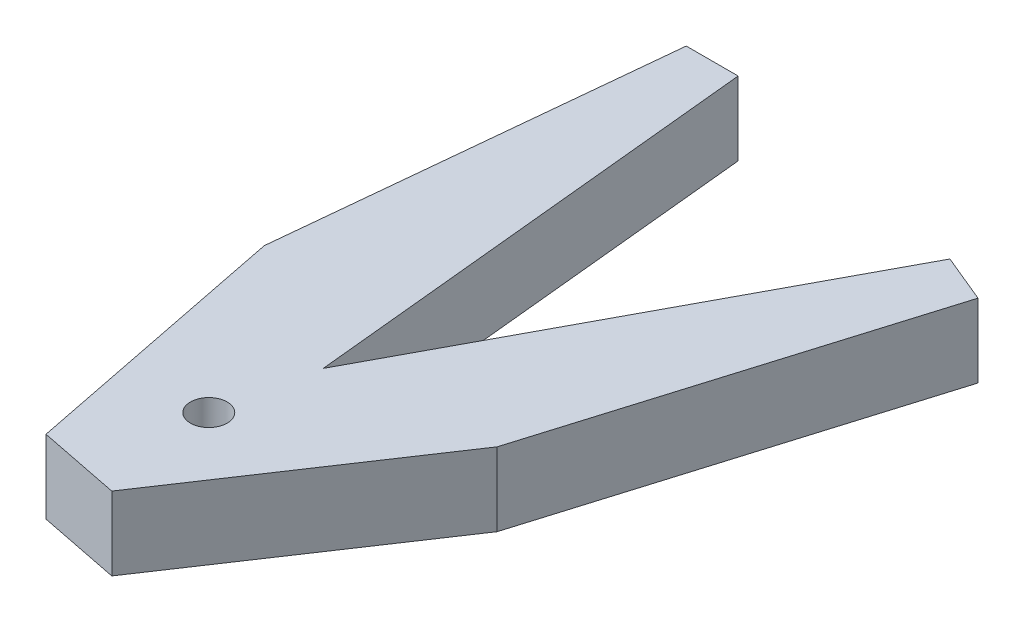
ISO-10303-21;
HEADER;
FILE_DESCRIPTION(('STEP AP214'),'2;1');
FILE_NAME('part.step','',(''),(''),'','','');
FILE_SCHEMA(('AUTOMOTIVE_DESIGN { 1 0 10303 214 1 1 1 1 }'));
ENDSEC;
DATA;
#1=APPLICATION_CONTEXT('core data for automotive mechanical design processes');
#2=APPLICATION_PROTOCOL_DEFINITION('international standard','automotive_design',2000,#1);
#3=PRODUCT_CONTEXT('',#1,'mechanical');
#4=PRODUCT('Part','Part','',(#3));
#5=PRODUCT_RELATED_PRODUCT_CATEGORY('part','',(#4));
#6=PRODUCT_DEFINITION_FORMATION('','',#4);
#7=PRODUCT_DEFINITION_CONTEXT('part definition',#1,'design');
#8=PRODUCT_DEFINITION('design','',#6,#7);
#9=PRODUCT_DEFINITION_SHAPE('','',#8);
#10=(LENGTH_UNIT() NAMED_UNIT(*) SI_UNIT(.MILLI.,.METRE.));
#11=(NAMED_UNIT(*) PLANE_ANGLE_UNIT() SI_UNIT($,.RADIAN.));
#12=(NAMED_UNIT(*) SI_UNIT($,.STERADIAN.) SOLID_ANGLE_UNIT());
#13=UNCERTAINTY_MEASURE_WITH_UNIT(LENGTH_MEASURE(1.E-05),#10,'distance_accuracy_value','');
#14=(GEOMETRIC_REPRESENTATION_CONTEXT(3) GLOBAL_UNCERTAINTY_ASSIGNED_CONTEXT((#13)) GLOBAL_UNIT_ASSIGNED_CONTEXT((#10,
#11,#12)) REPRESENTATION_CONTEXT('',''));
#15=CARTESIAN_POINT('',(0.,0.,0.));
#16=DIRECTION('',(0.,0.,1.));
#17=DIRECTION('',(1.,0.,0.));
#18=AXIS2_PLACEMENT_3D('',#15,#16,#17);
#19=CARTESIAN_POINT('',(5.10008345810155,17.,-1.01446967448503));
#20=DIRECTION('',(-0.980785280403222,0.,0.195090322016169));
#21=DIRECTION('',(0.195090322016169,0.,0.980785280403222));
#22=AXIS2_PLACEMENT_3D('',#19,#20,#21);
#23=PLANE('',#22);
#24=DIRECTION('',(-0.195090322016169,0.,-0.980785280403222));
#25=VECTOR('',#24,1.);
#26=CARTESIAN_POINT('',(5.10008345810155,0.,-1.01446967448503));
#27=LINE('',#26,#25);
#28=CARTESIAN_POINT('',(-2.28332232476133,0.,-38.1333571530355));
#29=VERTEX_POINT('',#28);
#30=CARTESIAN_POINT('',(-14.8168582119146,0.,-101.143697094502));
#31=VERTEX_POINT('',#30);
#32=EDGE_CURVE('E138',#29,#31,#27,.T.);
#33=ORIENTED_EDGE('',*,*,#32,.F.);
#34=DIRECTION('',(0.,-1.,0.));
#35=VECTOR('',#34,1.);
#36=CARTESIAN_POINT('',(-2.28332232476133,17.,-38.1333571530355));
#37=LINE('',#36,#35);
#38=CARTESIAN_POINT('',(-2.28332232476133,17.,-38.1333571530355));
#39=VERTEX_POINT('',#38);
#40=EDGE_CURVE('E11',#39,#29,#37,.T.);
#41=ORIENTED_EDGE('',*,*,#40,.F.);
#42=DIRECTION('',(-0.195090322016169,0.,-0.980785280403222));
#43=VECTOR('',#42,1.);
#44=CARTESIAN_POINT('',(5.10008345810155,17.,-1.01446967448503));
#45=LINE('',#44,#43);
#46=CARTESIAN_POINT('',(-14.8168582119146,17.,-101.143697094502));
#47=VERTEX_POINT('',#46);
#48=EDGE_CURVE('E194',#39,#47,#45,.T.);
#49=ORIENTED_EDGE('',*,*,#48,.T.);
#50=DIRECTION('',(0.,-1.,0.));
#51=VECTOR('',#50,1.);
#52=CARTESIAN_POINT('',(-14.8168582119146,17.,-101.143697094502));
#53=LINE('',#52,#51);
#54=EDGE_CURVE('E88',#47,#31,#53,.T.);
#55=ORIENTED_EDGE('',*,*,#54,.T.);
#56=EDGE_LOOP('',(#33,#41,#49,#55));
#57=FACE_BOUND('',#56,.T.);
#58=ADVANCED_FACE('F34',(#57),#23,.T.);
#59=CARTESIAN_POINT('',(7.20959822006962,17.,-36.2450978541162));
#60=DIRECTION('',(0.195090322016128,0.,-0.980785280403231));
#61=DIRECTION('',(-0.980785280403231,0.,-0.195090322016128));
#62=AXIS2_PLACEMENT_3D('',#59,#60,#61);
#63=PLANE('',#62);
#64=DIRECTION('',(0.98078528040323,0.,0.195090322016128));
#65=VECTOR('',#64,1.);
#66=CARTESIAN_POINT('',(7.20959822006962,0.,-36.2450978541162));
#67=LINE('',#66,#65);
#68=CARTESIAN_POINT('',(16.7025187649006,0.,-34.3568385551969));
#69=VERTEX_POINT('',#68);
#70=EDGE_CURVE('E141',#29,#69,#67,.T.);
#71=ORIENTED_EDGE('',*,*,#70,.T.);
#72=DIRECTION('',(0.,-1.,0.));
#73=VECTOR('',#72,1.);
#74=CARTESIAN_POINT('',(16.7025187649006,17.,-34.3568385551969));
#75=LINE('',#74,#73);
#76=CARTESIAN_POINT('',(16.7025187649006,17.,-34.3568385551969));
#77=VERTEX_POINT('',#76);
#78=EDGE_CURVE('E43',#77,#69,#75,.T.);
#79=ORIENTED_EDGE('',*,*,#78,.F.);
#80=DIRECTION('',(0.98078528040323,0.,0.195090322016128));
#81=VECTOR('',#80,1.);
#82=CARTESIAN_POINT('',(7.20959822006962,17.,-36.2450978541162));
#83=LINE('',#82,#81);
#84=EDGE_CURVE('E190',#39,#77,#83,.T.);
#85=ORIENTED_EDGE('',*,*,#84,.F.);
#86=ORIENTED_EDGE('',*,*,#40,.T.);
#87=EDGE_LOOP('',(#71,#79,#85,#86));
#88=FACE_BOUND('',#87,.T.);
#89=ADVANCED_FACE('F179',(#88),#63,.F.);
#90=CARTESIAN_POINT('',(-4.32364198397167,17.,-2.8889652117006));
#91=DIRECTION('',(0.831469612302571,0.,0.555570233019564));
#92=DIRECTION('',(0.555570233019564,0.,-0.831469612302571));
#93=AXIS2_PLACEMENT_3D('',#90,#91,#92);
#94=PLANE('',#93);
#95=DIRECTION('',(-0.555570233019564,0.,0.831469612302571));
#96=VECTOR('',#95,1.);
#97=CARTESIAN_POINT('',(-4.32364198397167,0.,-2.8889652117006));
#98=LINE('',#97,#96);
#99=CARTESIAN_POINT('',(52.3950092043296,0.,-87.7744254307324));
#100=VERTEX_POINT('',#99);
#101=EDGE_CURVE('E144',#100,#69,#98,.T.);
#102=ORIENTED_EDGE('',*,*,#101,.F.);
#103=DIRECTION('',(0.,-1.,0.));
#104=VECTOR('',#103,1.);
#105=CARTESIAN_POINT('',(52.3950092043296,17.,-87.7744254307324));
#106=LINE('',#105,#104);
#107=CARTESIAN_POINT('',(52.3950092043296,17.,-87.7744254307324));
#108=VERTEX_POINT('',#107);
#109=EDGE_CURVE('E169',#108,#100,#106,.T.);
#110=ORIENTED_EDGE('',*,*,#109,.F.);
#111=DIRECTION('',(-0.555570233019564,0.,0.831469612302571));
#112=VECTOR('',#111,1.);
#113=CARTESIAN_POINT('',(-4.32364198397167,17.,-2.8889652117006));
#114=LINE('',#113,#112);
#115=EDGE_CURVE('E176',#108,#77,#114,.T.);
#116=ORIENTED_EDGE('',*,*,#115,.T.);
#117=ORIENTED_EDGE('',*,*,#78,.T.);
#118=EDGE_LOOP('',(#102,#110,#116,#117));
#119=FACE_BOUND('',#118,.T.);
#120=ADVANCED_FACE('F174',(#119),#94,.T.);
#121=CARTESIAN_POINT('',(23.6824901650722,17.,7.16248257937049));
#122=DIRECTION('',(0.957181641551068,0.,0.289488005066881));
#123=DIRECTION('',(0.289488005066881,0.,-0.957181641551068));
#124=AXIS2_PLACEMENT_3D('',#121,#122,#123);
#125=PLANE('',#124);
#126=DIRECTION('',(-0.289488005066881,0.,0.957181641551068));
#127=VECTOR('',#126,1.);
#128=CARTESIAN_POINT('',(23.6824901650722,0.,7.16248257937049));
#129=LINE('',#128,#127);
#130=CARTESIAN_POINT('',(78.2168660815679,0.,-173.153463321927));
#131=VERTEX_POINT('',#130);
#132=EDGE_CURVE('E147',#131,#100,#129,.T.);
#133=ORIENTED_EDGE('',*,*,#132,.F.);
#134=DIRECTION('',(0.,-1.,0.));
#135=VECTOR('',#134,1.);
#136=CARTESIAN_POINT('',(78.2168660815679,17.,-173.153463321927));
#137=LINE('',#136,#135);
#138=CARTESIAN_POINT('',(78.2168660815679,17.,-173.153463321927));
#139=VERTEX_POINT('',#138);
#140=EDGE_CURVE('E167',#139,#131,#137,.T.);
#141=ORIENTED_EDGE('',*,*,#140,.F.);
#142=DIRECTION('',(-0.289488005066881,0.,0.957181641551068));
#143=VECTOR('',#142,1.);
#144=CARTESIAN_POINT('',(23.6824901650722,17.,7.16248257937049));
#145=LINE('',#144,#143);
#146=EDGE_CURVE('E188',#139,#108,#145,.T.);
#147=ORIENTED_EDGE('',*,*,#146,.T.);
#148=ORIENTED_EDGE('',*,*,#109,.T.);
#149=EDGE_LOOP('',(#133,#141,#147,#148));
#150=FACE_BOUND('',#149,.T.);
#151=ADVANCED_FACE('F185',(#150),#125,.T.);
#152=CARTESIAN_POINT('',(72.6735888864997,17.,-175.449563916118));
#153=DIRECTION('',(0.382683432365083,0.,-0.92387953251129));
#154=DIRECTION('',(-0.92387953251129,0.,-0.382683432365083));
#155=AXIS2_PLACEMENT_3D('',#152,#153,#154);
#156=PLANE('',#155);
#157=DIRECTION('',(0.92387953251129,0.,0.382683432365083));
#158=VECTOR('',#157,1.);
#159=CARTESIAN_POINT('',(72.6735888864997,0.,-175.449563916118));
#160=LINE('',#159,#158);
#161=CARTESIAN_POINT('',(67.1303116914324,0.,-177.745664510309));
#162=VERTEX_POINT('',#161);
#163=EDGE_CURVE('E150',#162,#131,#160,.T.);
#164=ORIENTED_EDGE('',*,*,#163,.F.);
#165=DIRECTION('',(0.,-1.,0.));
#166=VECTOR('',#165,1.);
#167=CARTESIAN_POINT('',(67.1303116914324,17.,-177.745664510309));
#168=LINE('',#167,#166);
#169=CARTESIAN_POINT('',(67.1303116914324,17.,-177.745664510309));
#170=VERTEX_POINT('',#169);
#171=EDGE_CURVE('E165',#170,#162,#168,.T.);
#172=ORIENTED_EDGE('',*,*,#171,.F.);
#173=DIRECTION('',(0.92387953251129,0.,0.382683432365083));
#174=VECTOR('',#173,1.);
#175=CARTESIAN_POINT('',(72.6735888864997,17.,-175.449563916118));
#176=LINE('',#175,#174);
#177=EDGE_CURVE('E192',#170,#139,#176,.T.);
#178=ORIENTED_EDGE('',*,*,#177,.T.);
#179=ORIENTED_EDGE('',*,*,#140,.T.);
#180=EDGE_LOOP('',(#164,#172,#178,#179));
#181=FACE_BOUND('',#180,.T.);
#182=ADVANCED_FACE('F227',(#181),#156,.T.);
#183=CARTESIAN_POINT('',(-21.8106893931107,17.,-11.6814093891033));
#184=DIRECTION('',(-0.881528561022991,0.,-0.47213069811307));
#185=DIRECTION('',(-0.47213069811307,0.,0.881528561022991));
#186=AXIS2_PLACEMENT_3D('',#183,#184,#185);
#187=PLANE('',#186);
#188=DIRECTION('',(0.47213069811307,0.,-0.881528561022991));
#189=VECTOR('',#188,1.);
#190=CARTESIAN_POINT('',(-21.8106893931107,0.,-11.6814093891033));
#191=LINE('',#190,#189);
#192=CARTESIAN_POINT('',(16.5826773713707,0.,-83.3667488342747));
#193=VERTEX_POINT('',#192);
#194=EDGE_CURVE('E153',#193,#162,#191,.T.);
#195=ORIENTED_EDGE('',*,*,#194,.F.);
#196=DIRECTION('',(0.,-1.,0.));
#197=VECTOR('',#196,1.);
#198=CARTESIAN_POINT('',(16.5826773713707,17.,-83.3667488342747));
#199=LINE('',#198,#197);
#200=CARTESIAN_POINT('',(16.5826773713707,17.,-83.3667488342747));
#201=VERTEX_POINT('',#200);
#202=EDGE_CURVE('E121',#201,#193,#199,.T.);
#203=ORIENTED_EDGE('',*,*,#202,.F.);
#204=DIRECTION('',(0.47213069811307,0.,-0.881528561022991));
#205=VECTOR('',#204,1.);
#206=CARTESIAN_POINT('',(-21.8106893931107,17.,-11.6814093891033));
#207=LINE('',#206,#205);
#208=EDGE_CURVE('E128',#201,#170,#207,.T.);
#209=ORIENTED_EDGE('',*,*,#208,.T.);
#210=ORIENTED_EDGE('',*,*,#171,.T.);
#211=EDGE_LOOP('',(#195,#203,#209,#210));
#212=FACE_BOUND('',#211,.T.);
#213=ADVANCED_FACE('F200',(#212),#187,.T.);
#214=CARTESIAN_POINT('',(24.6207313601397,17.,-2.44562556627335));
#215=DIRECTION('',(0.995102790932103,0.,-0.0988455131967986));
#216=DIRECTION('',(-0.0988455131967986,0.,-0.995102790932103));
#217=AXIS2_PLACEMENT_3D('',#214,#215,#216);
#218=PLANE('',#217);
#219=DIRECTION('',(0.0988455131967986,0.,0.995102790932103));
#220=VECTOR('',#219,1.);
#221=CARTESIAN_POINT('',(24.6207313601397,0.,-2.44562556627335));
#222=LINE('',#221,#220);
#223=CARTESIAN_POINT('',(6.,0.,-189.905239527508));
#224=VERTEX_POINT('',#223);
#225=EDGE_CURVE('E116',#224,#193,#222,.T.);
#226=ORIENTED_EDGE('',*,*,#225,.F.);
#227=DIRECTION('',(0.,-1.,0.));
#228=VECTOR('',#227,1.);
#229=CARTESIAN_POINT('',(6.,17.,-189.905239527508));
#230=LINE('',#229,#228);
#231=CARTESIAN_POINT('',(6.,17.,-189.905239527508));
#232=VERTEX_POINT('',#231);
#233=EDGE_CURVE('E111',#232,#224,#230,.T.);
#234=ORIENTED_EDGE('',*,*,#233,.F.);
#235=DIRECTION('',(0.0988455131967986,0.,0.995102790932103));
#236=VECTOR('',#235,1.);
#237=CARTESIAN_POINT('',(24.6207313601397,17.,-2.44562556627335));
#238=LINE('',#237,#236);
#239=EDGE_CURVE('E114',#232,#201,#238,.T.);
#240=ORIENTED_EDGE('',*,*,#239,.T.);
#241=ORIENTED_EDGE('',*,*,#202,.T.);
#242=EDGE_LOOP('',(#226,#234,#240,#241));
#243=FACE_BOUND('',#242,.T.);
#244=ADVANCED_FACE('F113',(#243),#218,.T.);
#245=CARTESIAN_POINT('',(0.,17.,-189.905239527508));
#246=DIRECTION('',(0.,0.,-1.));
#247=DIRECTION('',(-1.,0.,0.));
#248=AXIS2_PLACEMENT_3D('',#245,#246,#247);
#249=PLANE('',#248);
#250=DIRECTION('',(1.,0.,0.));
#251=VECTOR('',#250,1.);
#252=CARTESIAN_POINT('',(0.,0.,-189.905239527508));
#253=LINE('',#252,#251);
#254=CARTESIAN_POINT('',(-6.,0.,-189.905239527508));
#255=VERTEX_POINT('',#254);
#256=EDGE_CURVE('E157',#255,#224,#253,.T.);
#257=ORIENTED_EDGE('',*,*,#256,.F.);
#258=DIRECTION('',(0.,-1.,0.));
#259=VECTOR('',#258,1.);
#260=CARTESIAN_POINT('',(-6.,17.,-189.905239527508));
#261=LINE('',#260,#259);
#262=CARTESIAN_POINT('',(-6.,17.,-189.905239527508));
#263=VERTEX_POINT('',#262);
#264=EDGE_CURVE('E81',#263,#255,#261,.T.);
#265=ORIENTED_EDGE('',*,*,#264,.F.);
#266=DIRECTION('',(1.,0.,0.));
#267=VECTOR('',#266,1.);
#268=CARTESIAN_POINT('',(0.,17.,-189.905239527508));
#269=LINE('',#268,#267);
#270=EDGE_CURVE('E125',#263,#232,#269,.T.);
#271=ORIENTED_EDGE('',*,*,#270,.T.);
#272=ORIENTED_EDGE('',*,*,#233,.T.);
#273=EDGE_LOOP('',(#257,#265,#271,#272));
#274=FACE_BOUND('',#273,.T.);
#275=ADVANCED_FACE('F130',(#274),#249,.T.);
#276=CARTESIAN_POINT('',(12.193145126008,17.,-61.2990800252019));
#277=DIRECTION('',(0.,-1.,0.));
#278=DIRECTION('',(0.,0.,-1.));
#279=AXIS2_PLACEMENT_3D('',#276,#277,#278);
#280=CYLINDRICAL_SURFACE('',#279,4.25);
#281=CARTESIAN_POINT('',(12.193145126008,17.,-61.2990800252019));
#282=DIRECTION('',(0.,1.,0.));
#283=DIRECTION('',(0.,0.,1.));
#284=AXIS2_PLACEMENT_3D('',#281,#282,#283);
#285=CIRCLE('',#284,4.25);
#286=CARTESIAN_POINT('',(12.193145126008,17.,-57.0490800252019));
#287=VERTEX_POINT('',#286);
#288=EDGE_CURVE('E161',#287,#287,#285,.T.);
#289=ORIENTED_EDGE('',*,*,#288,.T.);
#290=EDGE_LOOP('',(#289));
#291=FACE_BOUND('',#290,.T.);
#292=CARTESIAN_POINT('',(12.193145126008,0.,-61.2990800252019));
#293=DIRECTION('',(0.,1.,0.));
#294=DIRECTION('',(0.,0.,1.));
#295=AXIS2_PLACEMENT_3D('',#292,#293,#294);
#296=CIRCLE('',#295,4.25);
#297=CARTESIAN_POINT('',(12.193145126008,0.,-57.0490800252019));
#298=VERTEX_POINT('',#297);
#299=EDGE_CURVE('E135',#298,#298,#296,.T.);
#300=ORIENTED_EDGE('',*,*,#299,.F.);
#301=EDGE_LOOP('',(#300));
#302=FACE_BOUND('',#301,.T.);
#303=ADVANCED_FACE('F36',(#291,#302),#280,.F.);
#304=CARTESIAN_POINT('',(-24.6207313601377,17.,-2.44562556627289));
#305=DIRECTION('',(0.995102790932104,0.,0.098845513196788));
#306=DIRECTION('',(0.098845513196788,0.,-0.995102790932105));
#307=AXIS2_PLACEMENT_3D('',#304,#305,#306);
#308=PLANE('',#307);
#309=DIRECTION('',(-0.098845513196788,0.,0.995102790932105));
#310=VECTOR('',#309,1.);
#311=CARTESIAN_POINT('',(-24.6207313601377,0.,-2.44562556627289));
#312=LINE('',#311,#310);
#313=EDGE_CURVE('E159',#255,#31,#312,.T.);
#314=ORIENTED_EDGE('',*,*,#313,.T.);
#315=ORIENTED_EDGE('',*,*,#54,.F.);
#316=DIRECTION('',(-0.098845513196788,0.,0.995102790932105));
#317=VECTOR('',#316,1.);
#318=CARTESIAN_POINT('',(-24.6207313601377,17.,-2.44562556627289));
#319=LINE('',#318,#317);
#320=EDGE_CURVE('E51',#263,#47,#319,.T.);
#321=ORIENTED_EDGE('',*,*,#320,.F.);
#322=ORIENTED_EDGE('',*,*,#264,.T.);
#323=EDGE_LOOP('',(#314,#315,#321,#322));
#324=FACE_BOUND('',#323,.T.);
#325=ADVANCED_FACE('F201',(#324),#308,.F.);
#326=CARTESIAN_POINT('',(0.,17.,0.));
#327=DIRECTION('',(0.,1.,0.));
#328=DIRECTION('',(0.,0.,1.));
#329=AXIS2_PLACEMENT_3D('',#326,#327,#328);
#330=PLANE('',#329);
#331=ORIENTED_EDGE('',*,*,#288,.F.);
#332=EDGE_LOOP('',(#331));
#333=FACE_BOUND('',#332,.T.);
#334=ORIENTED_EDGE('',*,*,#48,.F.);
#335=ORIENTED_EDGE('',*,*,#84,.T.);
#336=ORIENTED_EDGE('',*,*,#115,.F.);
#337=ORIENTED_EDGE('',*,*,#146,.F.);
#338=ORIENTED_EDGE('',*,*,#177,.F.);
#339=ORIENTED_EDGE('',*,*,#208,.F.);
#340=ORIENTED_EDGE('',*,*,#239,.F.);
#341=ORIENTED_EDGE('',*,*,#270,.F.);
#342=ORIENTED_EDGE('',*,*,#320,.T.);
#343=EDGE_LOOP('',(#334,#335,#336,#337,#338,#339,#340,#341,#342));
#344=FACE_BOUND('',#343,.T.);
#345=ADVANCED_FACE('F124',(#333,#344),#330,.T.);
#346=CARTESIAN_POINT('',(0.,0.,0.));
#347=DIRECTION('',(0.,1.,0.));
#348=DIRECTION('',(0.,0.,1.));
#349=AXIS2_PLACEMENT_3D('',#346,#347,#348);
#350=PLANE('',#349);
#351=ORIENTED_EDGE('',*,*,#299,.T.);
#352=EDGE_LOOP('',(#351));
#353=FACE_BOUND('',#352,.T.);
#354=ORIENTED_EDGE('',*,*,#32,.T.);
#355=ORIENTED_EDGE('',*,*,#313,.F.);
#356=ORIENTED_EDGE('',*,*,#256,.T.);
#357=ORIENTED_EDGE('',*,*,#225,.T.);
#358=ORIENTED_EDGE('',*,*,#194,.T.);
#359=ORIENTED_EDGE('',*,*,#163,.T.);
#360=ORIENTED_EDGE('',*,*,#132,.T.);
#361=ORIENTED_EDGE('',*,*,#101,.T.);
#362=ORIENTED_EDGE('',*,*,#70,.F.);
#363=EDGE_LOOP('',(#354,#355,#356,#357,#358,#359,#360,#361,#362));
#364=FACE_BOUND('',#363,.T.);
#365=ADVANCED_FACE('F181',(#353,#364),#350,.F.);
#366=CLOSED_SHELL('',(#58,#89,#120,#151,#182,#213,#244,#275,#303,#325,#345,#365));
#367=MANIFOLD_SOLID_BREP('B2',#366);
#368=ADVANCED_BREP_SHAPE_REPRESENTATION('',(#18,#367),#14);
#369=SHAPE_DEFINITION_REPRESENTATION(#9,#368);
ENDSEC;
END-ISO-10303-21;
